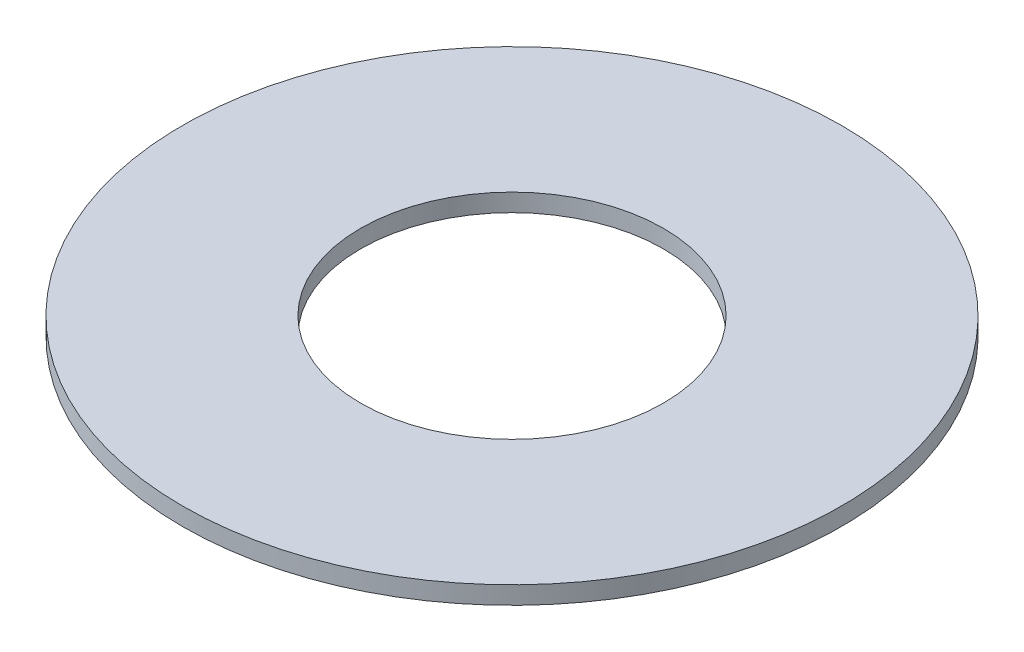
ISO-10303-21;
HEADER;
FILE_DESCRIPTION(('STEP AP214'),'2;1');
FILE_NAME('part.step','',(''),(''),'','','');
FILE_SCHEMA(('AUTOMOTIVE_DESIGN { 1 0 10303 214 1 1 1 1 }'));
ENDSEC;
DATA;
#1=APPLICATION_CONTEXT('core data for automotive mechanical design processes');
#2=APPLICATION_PROTOCOL_DEFINITION('international standard','automotive_design',2000,#1);
#3=PRODUCT_CONTEXT('',#1,'mechanical');
#4=PRODUCT('Part','Part','',(#3));
#5=PRODUCT_RELATED_PRODUCT_CATEGORY('part','',(#4));
#6=PRODUCT_DEFINITION_FORMATION('','',#4);
#7=PRODUCT_DEFINITION_CONTEXT('part definition',#1,'design');
#8=PRODUCT_DEFINITION('design','',#6,#7);
#9=PRODUCT_DEFINITION_SHAPE('','',#8);
#10=(LENGTH_UNIT() NAMED_UNIT(*) SI_UNIT(.MILLI.,.METRE.));
#11=(NAMED_UNIT(*) PLANE_ANGLE_UNIT() SI_UNIT($,.RADIAN.));
#12=(NAMED_UNIT(*) SI_UNIT($,.STERADIAN.) SOLID_ANGLE_UNIT());
#13=UNCERTAINTY_MEASURE_WITH_UNIT(LENGTH_MEASURE(1.E-05),#10,'distance_accuracy_value','');
#14=(GEOMETRIC_REPRESENTATION_CONTEXT(3) GLOBAL_UNCERTAINTY_ASSIGNED_CONTEXT((#13)) GLOBAL_UNIT_ASSIGNED_CONTEXT((#10,
#11,#12)) REPRESENTATION_CONTEXT('',''));
#15=CARTESIAN_POINT('',(0.,0.,0.));
#16=DIRECTION('',(0.,0.,1.));
#17=DIRECTION('',(1.,0.,0.));
#18=AXIS2_PLACEMENT_3D('',#15,#16,#17);
#19=CARTESIAN_POINT('',(0.,5.,0.));
#20=DIRECTION('',(0.,-1.,0.));
#21=DIRECTION('',(0.,0.,-1.));
#22=AXIS2_PLACEMENT_3D('',#19,#20,#21);
#23=CYLINDRICAL_SURFACE('',#22,92.5);
#24=CARTESIAN_POINT('',(0.,5.,0.));
#25=DIRECTION('',(0.,1.,0.));
#26=DIRECTION('',(0.,0.,1.));
#27=AXIS2_PLACEMENT_3D('',#24,#25,#26);
#28=CIRCLE('',#27,92.5);
#29=CARTESIAN_POINT('',(0.,5.,92.5));
#30=VERTEX_POINT('',#29);
#31=EDGE_CURVE('E10',#30,#30,#28,.T.);
#32=ORIENTED_EDGE('',*,*,#31,.F.);
#33=EDGE_LOOP('',(#32));
#34=FACE_BOUND('',#33,.T.);
#35=CARTESIAN_POINT('',(0.,0.,0.));
#36=DIRECTION('',(0.,1.,0.));
#37=DIRECTION('',(0.,0.,1.));
#38=AXIS2_PLACEMENT_3D('',#35,#36,#37);
#39=CIRCLE('',#38,92.5);
#40=CARTESIAN_POINT('',(0.,0.,92.5));
#41=VERTEX_POINT('',#40);
#42=EDGE_CURVE('E37',#41,#41,#39,.T.);
#43=ORIENTED_EDGE('',*,*,#42,.T.);
#44=EDGE_LOOP('',(#43));
#45=FACE_BOUND('',#44,.T.);
#46=ADVANCED_FACE('F40',(#34,#45),#23,.T.);
#47=CARTESIAN_POINT('',(0.,5.,0.));
#48=DIRECTION('',(0.,1.,0.));
#49=DIRECTION('',(0.,0.,1.));
#50=AXIS2_PLACEMENT_3D('',#47,#48,#49);
#51=PLANE('',#50);
#52=CARTESIAN_POINT('',(0.,5.,0.));
#53=DIRECTION('',(0.,1.,0.));
#54=DIRECTION('',(0.,0.,1.));
#55=AXIS2_PLACEMENT_3D('',#52,#53,#54);
#56=CIRCLE('',#55,42.5);
#57=CARTESIAN_POINT('',(0.,5.,42.5));
#58=VERTEX_POINT('',#57);
#59=EDGE_CURVE('E50',#58,#58,#56,.T.);
#60=ORIENTED_EDGE('',*,*,#59,.F.);
#61=EDGE_LOOP('',(#60));
#62=FACE_BOUND('',#61,.T.);
#63=ORIENTED_EDGE('',*,*,#31,.T.);
#64=EDGE_LOOP('',(#63));
#65=FACE_BOUND('',#64,.T.);
#66=ADVANCED_FACE('F59',(#62,#65),#51,.T.);
#67=CARTESIAN_POINT('',(0.,0.,0.));
#68=DIRECTION('',(0.,1.,0.));
#69=DIRECTION('',(0.,0.,1.));
#70=AXIS2_PLACEMENT_3D('',#67,#68,#69);
#71=PLANE('',#70);
#72=CARTESIAN_POINT('',(0.,0.,0.));
#73=DIRECTION('',(0.,1.,0.));
#74=DIRECTION('',(0.,0.,1.));
#75=AXIS2_PLACEMENT_3D('',#72,#73,#74);
#76=CIRCLE('',#75,42.5);
#77=CARTESIAN_POINT('',(0.,0.,42.5));
#78=VERTEX_POINT('',#77);
#79=EDGE_CURVE('E47',#78,#78,#76,.T.);
#80=ORIENTED_EDGE('',*,*,#79,.T.);
#81=EDGE_LOOP('',(#80));
#82=FACE_BOUND('',#81,.T.);
#83=ORIENTED_EDGE('',*,*,#42,.F.);
#84=EDGE_LOOP('',(#83));
#85=FACE_BOUND('',#84,.T.);
#86=ADVANCED_FACE('F58',(#82,#85),#71,.F.);
#87=CARTESIAN_POINT('',(0.,5.,0.));
#88=DIRECTION('',(0.,-1.,0.));
#89=DIRECTION('',(0.,0.,-1.));
#90=AXIS2_PLACEMENT_3D('',#87,#88,#89);
#91=CYLINDRICAL_SURFACE('',#90,42.5);
#92=ORIENTED_EDGE('',*,*,#59,.T.);
#93=EDGE_LOOP('',(#92));
#94=FACE_BOUND('',#93,.T.);
#95=ORIENTED_EDGE('',*,*,#79,.F.);
#96=EDGE_LOOP('',(#95));
#97=FACE_BOUND('',#96,.T.);
#98=ADVANCED_FACE('F54',(#94,#97),#91,.F.);
#99=CLOSED_SHELL('',(#46,#66,#86,#98));
#100=MANIFOLD_SOLID_BREP('B2',#99);
#101=ADVANCED_BREP_SHAPE_REPRESENTATION('',(#18,#100),#14);
#102=SHAPE_DEFINITION_REPRESENTATION(#9,#101);
ENDSEC;
END-ISO-10303-21;
